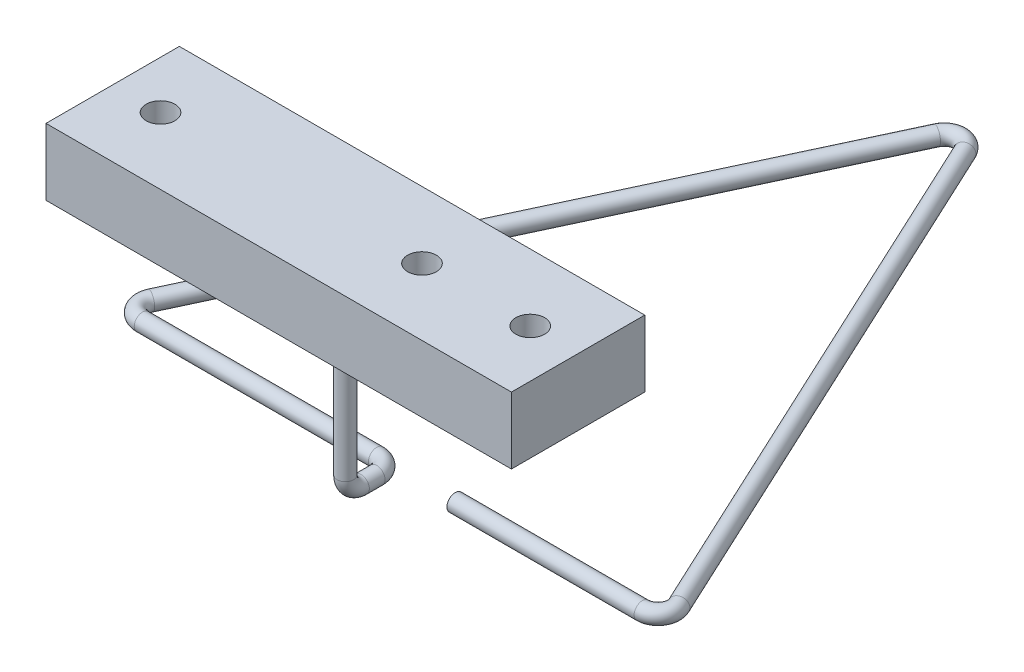
ISO-10303-21;
HEADER;
FILE_DESCRIPTION(('STEP AP214'),'2;1');
FILE_NAME('part.step','',(''),(''),'','','');
FILE_SCHEMA(('AUTOMOTIVE_DESIGN { 1 0 10303 214 1 1 1 1 }'));
ENDSEC;
DATA;
#1=APPLICATION_CONTEXT('core data for automotive mechanical design processes');
#2=APPLICATION_PROTOCOL_DEFINITION('international standard','automotive_design',2000,#1);
#3=PRODUCT_CONTEXT('',#1,'mechanical');
#4=PRODUCT('Part','Part','',(#3));
#5=PRODUCT_RELATED_PRODUCT_CATEGORY('part','',(#4));
#6=PRODUCT_DEFINITION_FORMATION('','',#4);
#7=PRODUCT_DEFINITION_CONTEXT('part definition',#1,'design');
#8=PRODUCT_DEFINITION('design','',#6,#7);
#9=PRODUCT_DEFINITION_SHAPE('','',#8);
#10=(LENGTH_UNIT() NAMED_UNIT(*) SI_UNIT(.MILLI.,.METRE.));
#11=(NAMED_UNIT(*) PLANE_ANGLE_UNIT() SI_UNIT($,.RADIAN.));
#12=(NAMED_UNIT(*) SI_UNIT($,.STERADIAN.) SOLID_ANGLE_UNIT());
#13=UNCERTAINTY_MEASURE_WITH_UNIT(LENGTH_MEASURE(1.E-05),#10,'distance_accuracy_value','');
#14=(GEOMETRIC_REPRESENTATION_CONTEXT(3) GLOBAL_UNCERTAINTY_ASSIGNED_CONTEXT((#13)) GLOBAL_UNIT_ASSIGNED_CONTEXT((#10,
#11,#12)) REPRESENTATION_CONTEXT('',''));
#15=CARTESIAN_POINT('',(0.,0.,0.));
#16=DIRECTION('',(0.,0.,1.));
#17=DIRECTION('',(1.,0.,0.));
#18=AXIS2_PLACEMENT_3D('',#15,#16,#17);
#19=CARTESIAN_POINT('',(9.21568546263006,-39.4854576651839,80.));
#20=DIRECTION('',(1.,0.,0.));
#21=DIRECTION('',(0.,0.,-1.));
#22=AXIS2_PLACEMENT_3D('',#19,#20,#21);
#23=PLANE('',#22);
#24=CARTESIAN_POINT('',(9.21568546263006,-39.4854576651839,80.));
#25=DIRECTION('',(1.,0.,0.));
#26=DIRECTION('',(0.,0.,-1.));
#27=AXIS2_PLACEMENT_3D('',#24,#25,#26);
#28=CIRCLE('',#27,1.585);
#29=CARTESIAN_POINT('',(9.21568546263006,-39.4854576651839,78.415));
#30=VERTEX_POINT('',#29);
#31=EDGE_CURVE('P0_E28',#30,#30,#28,.T.);
#32=ORIENTED_EDGE('',*,*,#31,.F.);
#33=EDGE_LOOP('',(#32));
#34=FACE_BOUND('',#33,.T.);
#35=ADVANCED_FACE('P0_F16',(#34),#23,.F.);
#36=CARTESIAN_POINT('',(9.21568546263006,-39.4854576651839,80.));
#37=DIRECTION('',(1.,0.,0.));
#38=DIRECTION('',(0.,0.,-1.));
#39=AXIS2_PLACEMENT_3D('',#36,#37,#38);
#40=CYLINDRICAL_SURFACE('',#39,1.585);
#41=CARTESIAN_POINT('',(45.0066287312776,-39.4854576651839,80.));
#42=DIRECTION('',(1.,0.,0.));
#43=DIRECTION('',(0.,0.,-1.));
#44=AXIS2_PLACEMENT_3D('',#41,#42,#43);
#45=CIRCLE('',#44,1.585);
#46=CARTESIAN_POINT('',(45.0066287312776,-39.4854576651839,81.585));
#47=VERTEX_POINT('',#46);
#48=EDGE_CURVE('P0_E37',#47,#47,#45,.T.);
#49=ORIENTED_EDGE('',*,*,#48,.F.);
#50=EDGE_LOOP('',(#49));
#51=FACE_BOUND('',#50,.T.);
#52=ORIENTED_EDGE('',*,*,#31,.T.);
#53=EDGE_LOOP('',(#52));
#54=FACE_BOUND('',#53,.T.);
#55=ADVANCED_FACE('P0_F98',(#51,#54),#40,.T.);
#56=CARTESIAN_POINT('',(45.0066287312776,-39.4854576651839,77.));
#57=DIRECTION('',(0.,1.,0.));
#58=DIRECTION('',(0.,0.,1.));
#59=AXIS2_PLACEMENT_3D('',#56,#57,#58);
#60=TOROIDAL_SURFACE('',#59,3.,1.585);
#61=CARTESIAN_POINT('',(47.7255520923876,-39.4854576651839,75.7321452147779));
#62=DIRECTION('',(-0.422618261740697,0.,-0.906307787036651));
#63=DIRECTION('',(-0.906307787036651,0.,0.422618261740697));
#64=AXIS2_PLACEMENT_3D('',#61,#62,#63);
#65=CIRCLE('',#64,1.585);
#66=CARTESIAN_POINT('',(49.1620499348407,-39.4854576651839,75.0622952699189));
#67=VERTEX_POINT('',#66);
#68=EDGE_CURVE('P0_E46',#67,#67,#65,.T.);
#69=CARTESIAN_POINT('',(45.0066287312776,-39.4854576651839,77.));
#70=DIRECTION('',(0.,1.,0.));
#71=DIRECTION('',(0.,0.,1.));
#72=AXIS2_PLACEMENT_3D('',#69,#70,#71);
#73=CIRCLE('',#72,4.585);
#74=EDGE_CURVE('',#47,#67,#73,.T.);
#75=ORIENTED_EDGE('',*,*,#48,.T.);
#76=ORIENTED_EDGE('',*,*,#68,.F.);
#77=ORIENTED_EDGE('',*,*,#74,.T.);
#78=ORIENTED_EDGE('',*,*,#74,.F.);
#79=EDGE_LOOP('',(#75,#77,#76,#78));
#80=FACE_BOUND('',#79,.T.);
#81=ADVANCED_FACE('P0_F92',(#80),#60,.T.);
#82=CARTESIAN_POINT('',(47.7255520923876,-39.4854576651839,75.7321452147779));
#83=DIRECTION('',(-0.422618261740697,0.,-0.906307787036651));
#84=DIRECTION('',(-0.906307787036651,0.,0.422618261740697));
#85=AXIS2_PLACEMENT_3D('',#82,#83,#84);
#86=CYLINDRICAL_SURFACE('',#85,1.585);
#87=CARTESIAN_POINT('',(-0.0653911762599785,-39.4854576651839,-26.7558633625171));
#88=DIRECTION('',(-0.422618261740697,0.,-0.906307787036651));
#89=DIRECTION('',(-0.906307787036651,0.,0.422618261740697));
#90=AXIS2_PLACEMENT_3D('',#87,#88,#89);
#91=CIRCLE('',#90,1.585);
#92=CARTESIAN_POINT('',(1.37110666619311,-39.4854576651839,-27.4257133073761));
#93=VERTEX_POINT('',#92);
#94=EDGE_CURVE('P0_E49',#93,#93,#91,.T.);
#95=ORIENTED_EDGE('',*,*,#94,.F.);
#96=EDGE_LOOP('',(#95));
#97=FACE_BOUND('',#96,.T.);
#98=ORIENTED_EDGE('',*,*,#68,.T.);
#99=EDGE_LOOP('',(#98));
#100=FACE_BOUND('',#99,.T.);
#101=ADVANCED_FACE('P0_F86',(#97,#100),#86,.T.);
#102=CARTESIAN_POINT('',(-2.78431453736993,-39.4854576651839,-25.488008577295));
#103=DIRECTION('',(0.,1.,0.));
#104=DIRECTION('',(0.,0.,1.));
#105=AXIS2_PLACEMENT_3D('',#102,#103,#104);
#106=TOROIDAL_SURFACE('',#105,3.,1.585);
#107=CARTESIAN_POINT('',(-5.50323789847988,-39.4854576651839,-26.7558633625171));
#108=DIRECTION('',(-0.422618261740698,0.,0.906307787036651));
#109=DIRECTION('',(0.906307787036651,0.,0.422618261740698));
#110=AXIS2_PLACEMENT_3D('',#107,#108,#109);
#111=CIRCLE('',#110,1.585);
#112=CARTESIAN_POINT('',(-6.93973574093297,-39.4854576651839,-27.4257133073761));
#113=VERTEX_POINT('',#112);
#114=EDGE_CURVE('P0_E52',#113,#113,#111,.T.);
#115=CARTESIAN_POINT('',(-2.78431453736993,-39.4854576651839,-25.488008577295));
#116=DIRECTION('',(0.,1.,0.));
#117=DIRECTION('',(0.,0.,1.));
#118=AXIS2_PLACEMENT_3D('',#115,#116,#117);
#119=CIRCLE('',#118,4.585);
#120=EDGE_CURVE('',#93,#113,#119,.T.);
#121=ORIENTED_EDGE('',*,*,#94,.T.);
#122=ORIENTED_EDGE('',*,*,#114,.F.);
#123=ORIENTED_EDGE('',*,*,#120,.T.);
#124=ORIENTED_EDGE('',*,*,#120,.F.);
#125=EDGE_LOOP('',(#121,#123,#122,#124));
#126=FACE_BOUND('',#125,.T.);
#127=ADVANCED_FACE('P0_F80',(#126),#106,.T.);
#128=CARTESIAN_POINT('',(-5.50323789847988,-39.4854576651839,-26.7558633625171));
#129=DIRECTION('',(-0.422618261740697,0.,0.906307787036651));
#130=DIRECTION('',(0.906307787036651,0.,0.422618261740697));
#131=AXIS2_PLACEMENT_3D('',#128,#129,#130);
#132=CYLINDRICAL_SURFACE('',#131,1.585);
#133=CARTESIAN_POINT('',(-53.2941811671274,-39.4854576651839,75.7321452147779));
#134=DIRECTION('',(-0.422618261740697,0.,0.906307787036651));
#135=DIRECTION('',(0.906307787036651,0.,0.422618261740697));
#136=AXIS2_PLACEMENT_3D('',#133,#134,#135);
#137=CIRCLE('',#136,1.585);
#138=CARTESIAN_POINT('',(-54.7306790095805,-39.4854576651839,75.0622952699189));
#139=VERTEX_POINT('',#138);
#140=EDGE_CURVE('P0_E55',#139,#139,#137,.T.);
#141=ORIENTED_EDGE('',*,*,#140,.F.);
#142=EDGE_LOOP('',(#141));
#143=FACE_BOUND('',#142,.T.);
#144=ORIENTED_EDGE('',*,*,#114,.T.);
#145=EDGE_LOOP('',(#144));
#146=FACE_BOUND('',#145,.T.);
#147=ADVANCED_FACE('P0_F74',(#143,#146),#132,.T.);
#148=CARTESIAN_POINT('',(-50.5752578060175,-39.4854576651839,77.));
#149=DIRECTION('',(0.,1.,0.));
#150=DIRECTION('',(0.,0.,1.));
#151=AXIS2_PLACEMENT_3D('',#148,#149,#150);
#152=TOROIDAL_SURFACE('',#151,3.,1.585);
#153=CARTESIAN_POINT('',(-50.5752578060175,-39.4854576651839,80.));
#154=DIRECTION('',(1.,0.,0.));
#155=DIRECTION('',(0.,0.,-1.));
#156=AXIS2_PLACEMENT_3D('',#153,#154,#155);
#157=CIRCLE('',#156,1.585);
#158=CARTESIAN_POINT('',(-50.5752578060175,-39.4854576651839,81.585));
#159=VERTEX_POINT('',#158);
#160=EDGE_CURVE('P0_E58',#159,#159,#157,.T.);
#161=CARTESIAN_POINT('',(-50.5752578060175,-39.4854576651839,77.));
#162=DIRECTION('',(0.,1.,0.));
#163=DIRECTION('',(0.,0.,1.));
#164=AXIS2_PLACEMENT_3D('',#161,#162,#163);
#165=CIRCLE('',#164,4.585);
#166=EDGE_CURVE('',#139,#159,#165,.T.);
#167=ORIENTED_EDGE('',*,*,#140,.T.);
#168=ORIENTED_EDGE('',*,*,#160,.F.);
#169=ORIENTED_EDGE('',*,*,#166,.T.);
#170=ORIENTED_EDGE('',*,*,#166,.F.);
#171=EDGE_LOOP('',(#167,#169,#168,#170));
#172=FACE_BOUND('',#171,.T.);
#173=ADVANCED_FACE('P0_F68',(#172),#152,.T.);
#174=CARTESIAN_POINT('',(-50.5752578060175,-39.4854576651839,80.));
#175=DIRECTION('',(1.,0.,0.));
#176=DIRECTION('',(0.,0.,-1.));
#177=AXIS2_PLACEMENT_3D('',#174,#175,#176);
#178=CYLINDRICAL_SURFACE('',#177,1.585);
#179=CARTESIAN_POINT('',(-5.78431453736994,-39.4854576651839,80.));
#180=DIRECTION('',(1.,0.,0.));
#181=DIRECTION('',(0.,0.,-1.));
#182=AXIS2_PLACEMENT_3D('',#179,#180,#181);
#183=CIRCLE('',#182,1.585);
#184=CARTESIAN_POINT('',(-5.78431453736993,-39.4854576651839,78.415));
#185=VERTEX_POINT('',#184);
#186=EDGE_CURVE('P0_E23',#185,#185,#183,.T.);
#187=ORIENTED_EDGE('',*,*,#186,.F.);
#188=EDGE_LOOP('',(#187));
#189=FACE_BOUND('',#188,.T.);
#190=ORIENTED_EDGE('',*,*,#160,.T.);
#191=EDGE_LOOP('',(#190));
#192=FACE_BOUND('',#191,.T.);
#193=ADVANCED_FACE('P0_F65',(#189,#192),#178,.T.);
#194=CARTESIAN_POINT('',(-5.78431453736994,-39.4854576651839,83.));
#195=DIRECTION('',(0.,-1.,0.));
#196=DIRECTION('',(0.,0.,-1.));
#197=AXIS2_PLACEMENT_3D('',#194,#195,#196);
#198=TOROIDAL_SURFACE('',#197,3.,1.585);
#199=CARTESIAN_POINT('',(-2.78431453736994,-39.4854576651839,83.));
#200=DIRECTION('',(0.,0.,1.));
#201=DIRECTION('',(1.,0.,0.));
#202=AXIS2_PLACEMENT_3D('',#199,#200,#201);
#203=CIRCLE('',#202,1.585);
#204=CARTESIAN_POINT('',(-1.19931453736994,-39.4854576651839,83.));
#205=VERTEX_POINT('',#204);
#206=EDGE_CURVE('P0_E10',#205,#205,#203,.T.);
#207=CARTESIAN_POINT('',(-5.78431453736994,-39.4854576651839,83.));
#208=DIRECTION('',(0.,-1.,0.));
#209=DIRECTION('',(0.,0.,-1.));
#210=AXIS2_PLACEMENT_3D('',#207,#208,#209);
#211=CIRCLE('',#210,4.585);
#212=EDGE_CURVE('',#185,#205,#211,.T.);
#213=ORIENTED_EDGE('',*,*,#186,.T.);
#214=ORIENTED_EDGE('',*,*,#206,.F.);
#215=ORIENTED_EDGE('',*,*,#212,.T.);
#216=ORIENTED_EDGE('',*,*,#212,.F.);
#217=EDGE_LOOP('',(#213,#215,#214,#216));
#218=FACE_BOUND('',#217,.T.);
#219=ADVANCED_FACE('P0_F63',(#218),#198,.T.);
#220=CARTESIAN_POINT('',(-2.78431453736994,-39.4854576651839,83.));
#221=DIRECTION('',(0.,0.,1.));
#222=DIRECTION('',(1.,0.,0.));
#223=AXIS2_PLACEMENT_3D('',#220,#221,#222);
#224=CYLINDRICAL_SURFACE('',#223,1.585);
#225=ORIENTED_EDGE('',*,*,#206,.T.);
#226=EDGE_LOOP('',(#225));
#227=FACE_BOUND('',#226,.T.);
#228=CARTESIAN_POINT('',(-2.78431453736994,-39.4854576651839,86.));
#229=DIRECTION('',(0.,0.,1.));
#230=DIRECTION('',(1.,0.,0.));
#231=AXIS2_PLACEMENT_3D('',#228,#229,#230);
#232=CIRCLE('',#231,1.585);
#233=CARTESIAN_POINT('',(-2.78431453736994,-41.0704576651839,86.));
#234=VERTEX_POINT('',#233);
#235=EDGE_CURVE('P0_E40',#234,#234,#232,.T.);
#236=ORIENTED_EDGE('',*,*,#235,.F.);
#237=EDGE_LOOP('',(#236));
#238=FACE_BOUND('',#237,.T.);
#239=ADVANCED_FACE('P0_F111',(#227,#238),#224,.T.);
#240=CARTESIAN_POINT('',(-2.78431453736994,-6.88545766518387,89.));
#241=DIRECTION('',(0.,1.,0.));
#242=DIRECTION('',(1.,0.,0.));
#243=AXIS2_PLACEMENT_3D('',#240,#241,#242);
#244=PLANE('',#243);
#245=CARTESIAN_POINT('',(-2.78431453736994,-6.88545766518387,89.));
#246=DIRECTION('',(0.,1.,0.));
#247=DIRECTION('',(1.,0.,0.));
#248=AXIS2_PLACEMENT_3D('',#245,#246,#247);
#249=CIRCLE('',#248,1.585);
#250=CARTESIAN_POINT('',(-1.19931453736994,-6.88545766518387,89.));
#251=VERTEX_POINT('',#250);
#252=EDGE_CURVE('P0_E32',#251,#251,#249,.T.);
#253=ORIENTED_EDGE('',*,*,#252,.T.);
#254=EDGE_LOOP('',(#253));
#255=FACE_BOUND('',#254,.T.);
#256=ADVANCED_FACE('P0_F33',(#255),#244,.T.);
#257=CARTESIAN_POINT('',(-2.78431453736994,-36.4854576651839,86.));
#258=DIRECTION('',(-1.,0.,0.));
#259=DIRECTION('',(0.,0.,1.));
#260=AXIS2_PLACEMENT_3D('',#257,#258,#259);
#261=TOROIDAL_SURFACE('',#260,3.,1.585);
#262=CARTESIAN_POINT('',(-2.78431453736994,-36.4854576651839,89.));
#263=DIRECTION('',(0.,1.,0.));
#264=DIRECTION('',(1.,0.,0.));
#265=AXIS2_PLACEMENT_3D('',#262,#263,#264);
#266=CIRCLE('',#265,1.585);
#267=CARTESIAN_POINT('',(-2.78431453736994,-36.4854576651839,90.585));
#268=VERTEX_POINT('',#267);
#269=EDGE_CURVE('P0_E35',#268,#268,#266,.T.);
#270=CARTESIAN_POINT('',(-2.78431453736994,-36.4854576651839,86.));
#271=DIRECTION('',(-1.,0.,0.));
#272=DIRECTION('',(0.,0.,1.));
#273=AXIS2_PLACEMENT_3D('',#270,#271,#272);
#274=CIRCLE('',#273,4.585);
#275=EDGE_CURVE('',#234,#268,#274,.T.);
#276=ORIENTED_EDGE('',*,*,#235,.T.);
#277=ORIENTED_EDGE('',*,*,#269,.F.);
#278=ORIENTED_EDGE('',*,*,#275,.T.);
#279=ORIENTED_EDGE('',*,*,#275,.F.);
#280=EDGE_LOOP('',(#276,#278,#277,#279));
#281=FACE_BOUND('',#280,.T.);
#282=ADVANCED_FACE('P0_F118',(#281),#261,.T.);
#283=CARTESIAN_POINT('',(-2.78431453736994,-36.4854576651839,89.));
#284=DIRECTION('',(0.,1.,0.));
#285=DIRECTION('',(0.,0.,1.));
#286=AXIS2_PLACEMENT_3D('',#283,#284,#285);
#287=CYLINDRICAL_SURFACE('',#286,1.585);
#288=ORIENTED_EDGE('',*,*,#252,.F.);
#289=EDGE_LOOP('',(#288));
#290=FACE_BOUND('',#289,.T.);
#291=ORIENTED_EDGE('',*,*,#269,.T.);
#292=EDGE_LOOP('',(#291));
#293=FACE_BOUND('',#292,.T.);
#294=ADVANCED_FACE('P0_F109',(#290,#293),#287,.T.);
#295=CLOSED_SHELL('',(#35,#55,#81,#101,#127,#147,#173,#193,#219,#239,#256,#282,#294));
#296=MANIFOLD_SOLID_BREP('P0_B1',#295);
#297=CARTESIAN_POINT('',(41.7156854626301,5.86454233481613,101.75));
#298=DIRECTION('',(0.,1.,0.));
#299=DIRECTION('',(0.,0.,1.));
#300=AXIS2_PLACEMENT_3D('',#297,#298,#299);
#301=PLANE('',#300);
#302=CARTESIAN_POINT('',(32.5656854626301,5.86454233481613,89.));
#303=DIRECTION('',(0.,1.,0.));
#304=DIRECTION('',(0.,0.,1.));
#305=AXIS2_PLACEMENT_3D('',#302,#303,#304);
#306=CIRCLE('',#305,2.75);
#307=CARTESIAN_POINT('',(32.5656854626301,5.86454233481613,91.75));
#308=VERTEX_POINT('',#307);
#309=EDGE_CURVE('P1_E99',#308,#308,#306,.T.);
#310=ORIENTED_EDGE('',*,*,#309,.F.);
#311=EDGE_LOOP('',(#310));
#312=FACE_BOUND('',#311,.T.);
#313=DIRECTION('',(0.,0.,-1.));
#314=VECTOR('',#313,1.);
#315=CARTESIAN_POINT('',(41.7156854626301,5.86454233481613,101.75));
#316=LINE('',#315,#314);
#317=CARTESIAN_POINT('',(41.7156854626301,5.86454233481613,101.75));
#318=VERTEX_POINT('',#317);
#319=CARTESIAN_POINT('',(41.7156854626301,5.86454233481613,76.25));
#320=VERTEX_POINT('',#319);
#321=EDGE_CURVE('P1_E69',#318,#320,#316,.T.);
#322=ORIENTED_EDGE('',*,*,#321,.T.);
#323=DIRECTION('',(-1.,0.,0.));
#324=VECTOR('',#323,1.);
#325=CARTESIAN_POINT('',(41.7156854626301,5.86454233481613,76.25));
#326=LINE('',#325,#324);
#327=CARTESIAN_POINT('',(-47.2843145373699,5.86454233481613,76.25));
#328=VERTEX_POINT('',#327);
#329=EDGE_CURVE('P1_E64',#320,#328,#326,.T.);
#330=ORIENTED_EDGE('',*,*,#329,.T.);
#331=DIRECTION('',(0.,0.,1.));
#332=VECTOR('',#331,1.);
#333=CARTESIAN_POINT('',(-47.2843145373699,5.86454233481613,101.75));
#334=LINE('',#333,#332);
#335=CARTESIAN_POINT('',(-47.2843145373699,5.86454233481613,101.75));
#336=VERTEX_POINT('',#335);
#337=EDGE_CURVE('P1_E67',#328,#336,#334,.T.);
#338=ORIENTED_EDGE('',*,*,#337,.T.);
#339=DIRECTION('',(1.,0.,0.));
#340=VECTOR('',#339,1.);
#341=CARTESIAN_POINT('',(41.7156854626301,5.86454233481613,101.75));
#342=LINE('',#341,#340);
#343=EDGE_CURVE('P1_E34',#336,#318,#342,.T.);
#344=ORIENTED_EDGE('',*,*,#343,.T.);
#345=EDGE_LOOP('',(#322,#330,#338,#344));
#346=FACE_BOUND('',#345,.T.);
#347=CARTESIAN_POINT('',(-38.1343145373699,5.86454233481613,89.));
#348=DIRECTION('',(0.,1.,0.));
#349=DIRECTION('',(0.,0.,1.));
#350=AXIS2_PLACEMENT_3D('',#347,#348,#349);
#351=CIRCLE('',#350,2.74999999999999);
#352=CARTESIAN_POINT('',(-38.1343145373699,5.86454233481613,91.75));
#353=VERTEX_POINT('',#352);
#354=EDGE_CURVE('P1_E84',#353,#353,#351,.T.);
#355=ORIENTED_EDGE('',*,*,#354,.F.);
#356=EDGE_LOOP('',(#355));
#357=FACE_BOUND('',#356,.T.);
#358=CARTESIAN_POINT('',(11.8656854626301,5.86454233481613,89.));
#359=DIRECTION('',(0.,1.,0.));
#360=DIRECTION('',(0.,0.,1.));
#361=AXIS2_PLACEMENT_3D('',#358,#359,#360);
#362=CIRCLE('',#361,2.75);
#363=CARTESIAN_POINT('',(11.8656854626301,5.86454233481613,91.75));
#364=VERTEX_POINT('',#363);
#365=EDGE_CURVE('P1_E105',#364,#364,#362,.T.);
#366=ORIENTED_EDGE('',*,*,#365,.F.);
#367=EDGE_LOOP('',(#366));
#368=FACE_BOUND('',#367,.T.);
#369=ADVANCED_FACE('P1_F17',(#312,#346,#357,#368),#301,.T.);
#370=CARTESIAN_POINT('',(41.7156854626301,-6.88545766518387,101.75));
#371=DIRECTION('',(0.,1.,0.));
#372=DIRECTION('',(0.,0.,1.));
#373=AXIS2_PLACEMENT_3D('',#370,#371,#372);
#374=PLANE('',#373);
#375=DIRECTION('',(0.,0.,-1.));
#376=VECTOR('',#375,1.);
#377=CARTESIAN_POINT('',(41.7156854626301,-6.88545766518387,101.75));
#378=LINE('',#377,#376);
#379=CARTESIAN_POINT('',(41.7156854626301,-6.88545766518387,101.75));
#380=VERTEX_POINT('',#379);
#381=CARTESIAN_POINT('',(41.7156854626301,-6.88545766518387,76.25));
#382=VERTEX_POINT('',#381);
#383=EDGE_CURVE('P1_E81',#380,#382,#378,.T.);
#384=ORIENTED_EDGE('',*,*,#383,.F.);
#385=DIRECTION('',(1.,0.,0.));
#386=VECTOR('',#385,1.);
#387=CARTESIAN_POINT('',(41.7156854626301,-6.88545766518387,101.75));
#388=LINE('',#387,#386);
#389=CARTESIAN_POINT('',(-47.2843145373699,-6.88545766518387,101.75));
#390=VERTEX_POINT('',#389);
#391=EDGE_CURVE('P1_E57',#390,#380,#388,.T.);
#392=ORIENTED_EDGE('',*,*,#391,.F.);
#393=DIRECTION('',(0.,0.,1.));
#394=VECTOR('',#393,1.);
#395=CARTESIAN_POINT('',(-47.2843145373699,-6.88545766518387,101.75));
#396=LINE('',#395,#394);
#397=CARTESIAN_POINT('',(-47.2843145373699,-6.88545766518387,76.25));
#398=VERTEX_POINT('',#397);
#399=EDGE_CURVE('P1_E51',#398,#390,#396,.T.);
#400=ORIENTED_EDGE('',*,*,#399,.F.);
#401=DIRECTION('',(-1.,0.,0.));
#402=VECTOR('',#401,1.);
#403=CARTESIAN_POINT('',(41.7156854626301,-6.88545766518387,76.25));
#404=LINE('',#403,#402);
#405=EDGE_CURVE('P1_E73',#382,#398,#404,.T.);
#406=ORIENTED_EDGE('',*,*,#405,.F.);
#407=EDGE_LOOP('',(#384,#392,#400,#406));
#408=FACE_BOUND('',#407,.T.);
#409=CARTESIAN_POINT('',(-38.1343145373699,-6.88545766518387,89.));
#410=DIRECTION('',(0.,1.,0.));
#411=DIRECTION('',(0.,0.,1.));
#412=AXIS2_PLACEMENT_3D('',#409,#410,#411);
#413=CIRCLE('',#412,2.74999999999999);
#414=CARTESIAN_POINT('',(-38.1343145373699,-6.88545766518387,91.75));
#415=VERTEX_POINT('',#414);
#416=EDGE_CURVE('P1_E96',#415,#415,#413,.T.);
#417=ORIENTED_EDGE('',*,*,#416,.T.);
#418=EDGE_LOOP('',(#417));
#419=FACE_BOUND('',#418,.T.);
#420=CARTESIAN_POINT('',(32.5656854626301,-6.88545766518387,89.));
#421=DIRECTION('',(0.,1.,0.));
#422=DIRECTION('',(0.,0.,1.));
#423=AXIS2_PLACEMENT_3D('',#420,#421,#422);
#424=CIRCLE('',#423,2.75);
#425=CARTESIAN_POINT('',(32.5656854626301,-6.88545766518387,91.75));
#426=VERTEX_POINT('',#425);
#427=EDGE_CURVE('P1_E102',#426,#426,#424,.T.);
#428=ORIENTED_EDGE('',*,*,#427,.T.);
#429=EDGE_LOOP('',(#428));
#430=FACE_BOUND('',#429,.T.);
#431=CARTESIAN_POINT('',(11.8656854626301,-6.88545766518387,89.));
#432=DIRECTION('',(0.,1.,0.));
#433=DIRECTION('',(0.,0.,1.));
#434=AXIS2_PLACEMENT_3D('',#431,#432,#433);
#435=CIRCLE('',#434,2.75);
#436=CARTESIAN_POINT('',(11.8656854626301,-6.88545766518387,91.75));
#437=VERTEX_POINT('',#436);
#438=EDGE_CURVE('P1_E108',#437,#437,#435,.T.);
#439=ORIENTED_EDGE('',*,*,#438,.T.);
#440=EDGE_LOOP('',(#439));
#441=FACE_BOUND('',#440,.T.);
#442=ADVANCED_FACE('P1_F92',(#408,#419,#430,#441),#374,.F.);
#443=CARTESIAN_POINT('',(41.7156854626301,5.86454233481613,101.75));
#444=DIRECTION('',(-1.,0.,0.));
#445=DIRECTION('',(0.,0.,1.));
#446=AXIS2_PLACEMENT_3D('',#443,#444,#445);
#447=PLANE('',#446);
#448=ORIENTED_EDGE('',*,*,#383,.T.);
#449=DIRECTION('',(0.,-1.,0.));
#450=VECTOR('',#449,1.);
#451=CARTESIAN_POINT('',(41.7156854626301,5.86454233481613,76.25));
#452=LINE('',#451,#450);
#453=EDGE_CURVE('P1_E11',#320,#382,#452,.T.);
#454=ORIENTED_EDGE('',*,*,#453,.F.);
#455=ORIENTED_EDGE('',*,*,#321,.F.);
#456=DIRECTION('',(0.,-1.,0.));
#457=VECTOR('',#456,1.);
#458=CARTESIAN_POINT('',(41.7156854626301,5.86454233481613,101.75));
#459=LINE('',#458,#457);
#460=EDGE_CURVE('P1_E77',#318,#380,#459,.T.);
#461=ORIENTED_EDGE('',*,*,#460,.T.);
#462=EDGE_LOOP('',(#448,#454,#455,#461));
#463=FACE_BOUND('',#462,.T.);
#464=ADVANCED_FACE('P1_F19',(#463),#447,.F.);
#465=CARTESIAN_POINT('',(41.7156854626301,5.86454233481613,76.25));
#466=DIRECTION('',(0.,0.,1.));
#467=DIRECTION('',(1.,0.,0.));
#468=AXIS2_PLACEMENT_3D('',#465,#466,#467);
#469=PLANE('',#468);
#470=ORIENTED_EDGE('',*,*,#405,.T.);
#471=DIRECTION('',(0.,-1.,0.));
#472=VECTOR('',#471,1.);
#473=CARTESIAN_POINT('',(-47.2843145373699,5.86454233481613,76.25));
#474=LINE('',#473,#472);
#475=EDGE_CURVE('P1_E26',#328,#398,#474,.T.);
#476=ORIENTED_EDGE('',*,*,#475,.F.);
#477=ORIENTED_EDGE('',*,*,#329,.F.);
#478=ORIENTED_EDGE('',*,*,#453,.T.);
#479=EDGE_LOOP('',(#470,#476,#477,#478));
#480=FACE_BOUND('',#479,.T.);
#481=ADVANCED_FACE('P1_F72',(#480),#469,.F.);
#482=CARTESIAN_POINT('',(-47.2843145373699,5.86454233481613,101.75));
#483=DIRECTION('',(1.,0.,0.));
#484=DIRECTION('',(0.,0.,-1.));
#485=AXIS2_PLACEMENT_3D('',#482,#483,#484);
#486=PLANE('',#485);
#487=ORIENTED_EDGE('',*,*,#399,.T.);
#488=DIRECTION('',(0.,-1.,0.));
#489=VECTOR('',#488,1.);
#490=CARTESIAN_POINT('',(-47.2843145373699,5.86454233481613,101.75));
#491=LINE('',#490,#489);
#492=EDGE_CURVE('P1_E74',#336,#390,#491,.T.);
#493=ORIENTED_EDGE('',*,*,#492,.F.);
#494=ORIENTED_EDGE('',*,*,#337,.F.);
#495=ORIENTED_EDGE('',*,*,#475,.T.);
#496=EDGE_LOOP('',(#487,#493,#494,#495));
#497=FACE_BOUND('',#496,.T.);
#498=ADVANCED_FACE('P1_F75',(#497),#486,.F.);
#499=CARTESIAN_POINT('',(41.7156854626301,5.86454233481613,101.75));
#500=DIRECTION('',(0.,0.,-1.));
#501=DIRECTION('',(-1.,0.,0.));
#502=AXIS2_PLACEMENT_3D('',#499,#500,#501);
#503=PLANE('',#502);
#504=ORIENTED_EDGE('',*,*,#391,.T.);
#505=ORIENTED_EDGE('',*,*,#460,.F.);
#506=ORIENTED_EDGE('',*,*,#343,.F.);
#507=ORIENTED_EDGE('',*,*,#492,.T.);
#508=EDGE_LOOP('',(#504,#505,#506,#507));
#509=FACE_BOUND('',#508,.T.);
#510=ADVANCED_FACE('P1_F89',(#509),#503,.F.);
#511=CARTESIAN_POINT('',(-38.1343145373699,5.86454233481613,89.));
#512=DIRECTION('',(0.,-1.,0.));
#513=DIRECTION('',(0.,0.,-1.));
#514=AXIS2_PLACEMENT_3D('',#511,#512,#513);
#515=CYLINDRICAL_SURFACE('',#514,2.74999999999999);
#516=ORIENTED_EDGE('',*,*,#354,.T.);
#517=EDGE_LOOP('',(#516));
#518=FACE_BOUND('',#517,.T.);
#519=ORIENTED_EDGE('',*,*,#416,.F.);
#520=EDGE_LOOP('',(#519));
#521=FACE_BOUND('',#520,.T.);
#522=ADVANCED_FACE('P1_F127',(#518,#521),#515,.F.);
#523=CARTESIAN_POINT('',(32.5656854626301,5.86454233481613,89.));
#524=DIRECTION('',(0.,-1.,0.));
#525=DIRECTION('',(0.,0.,-1.));
#526=AXIS2_PLACEMENT_3D('',#523,#524,#525);
#527=CYLINDRICAL_SURFACE('',#526,2.75);
#528=ORIENTED_EDGE('',*,*,#309,.T.);
#529=EDGE_LOOP('',(#528));
#530=FACE_BOUND('',#529,.T.);
#531=ORIENTED_EDGE('',*,*,#427,.F.);
#532=EDGE_LOOP('',(#531));
#533=FACE_BOUND('',#532,.T.);
#534=ADVANCED_FACE('P1_F180',(#530,#533),#527,.F.);
#535=CARTESIAN_POINT('',(11.8656854626301,5.86454233481613,89.));
#536=DIRECTION('',(0.,-1.,0.));
#537=DIRECTION('',(0.,0.,-1.));
#538=AXIS2_PLACEMENT_3D('',#535,#536,#537);
#539=CYLINDRICAL_SURFACE('',#538,2.75);
#540=ORIENTED_EDGE('',*,*,#365,.T.);
#541=EDGE_LOOP('',(#540));
#542=FACE_BOUND('',#541,.T.);
#543=ORIENTED_EDGE('',*,*,#438,.F.);
#544=EDGE_LOOP('',(#543));
#545=FACE_BOUND('',#544,.T.);
#546=ADVANCED_FACE('P1_F114',(#542,#545),#539,.F.);
#547=CLOSED_SHELL('',(#369,#442,#464,#481,#498,#510,#522,#534,#546));
#548=MANIFOLD_SOLID_BREP('P1_B1',#547);
#549=ADVANCED_BREP_SHAPE_REPRESENTATION('',(#18,#296,#548),#14);
#550=SHAPE_DEFINITION_REPRESENTATION(#9,#549);
ENDSEC;
END-ISO-10303-21;
